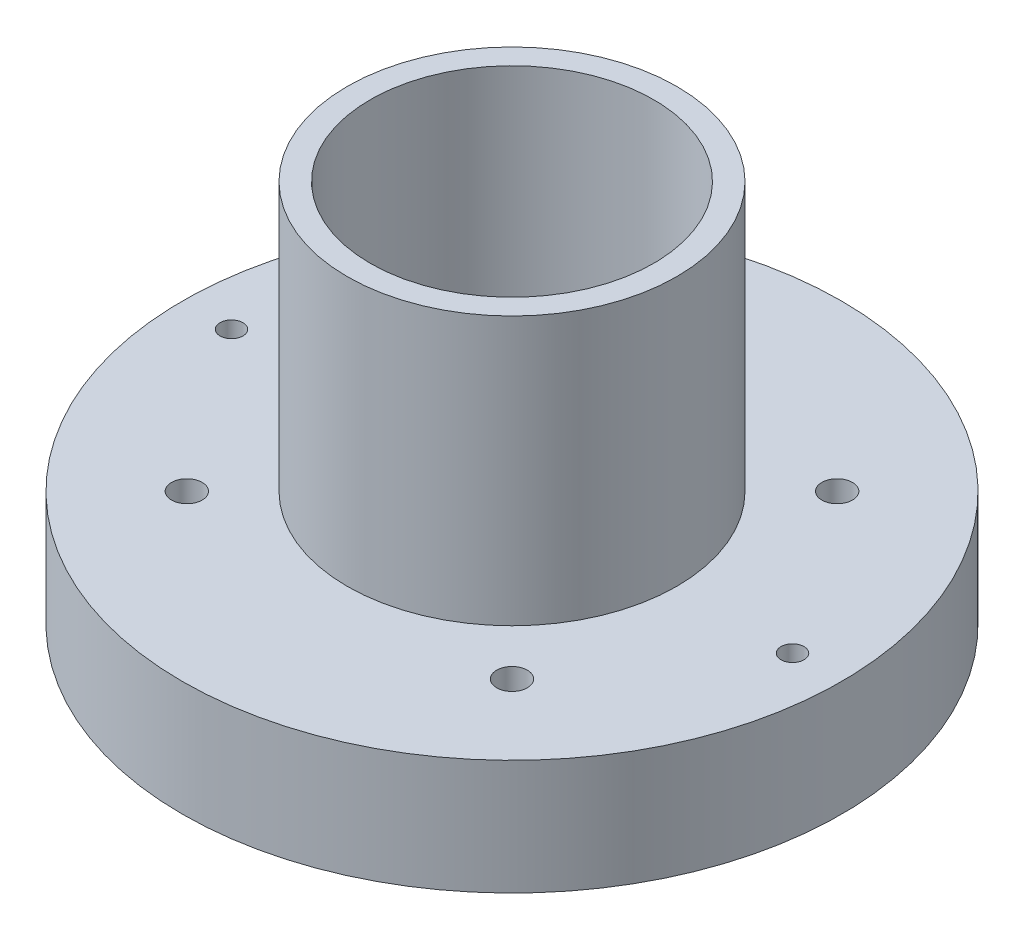
ISO-10303-21;
HEADER;
FILE_DESCRIPTION(('STEP AP214'),'2;1');
FILE_NAME('part.step','',(''),(''),'','','');
FILE_SCHEMA(('AUTOMOTIVE_DESIGN { 1 0 10303 214 1 1 1 1 }'));
ENDSEC;
DATA;
#1=APPLICATION_CONTEXT('core data for automotive mechanical design processes');
#2=APPLICATION_PROTOCOL_DEFINITION('international standard','automotive_design',2000,#1);
#3=PRODUCT_CONTEXT('',#1,'mechanical');
#4=PRODUCT('Part','Part','',(#3));
#5=PRODUCT_RELATED_PRODUCT_CATEGORY('part','',(#4));
#6=PRODUCT_DEFINITION_FORMATION('','',#4);
#7=PRODUCT_DEFINITION_CONTEXT('part definition',#1,'design');
#8=PRODUCT_DEFINITION('design','',#6,#7);
#9=PRODUCT_DEFINITION_SHAPE('','',#8);
#10=(LENGTH_UNIT() NAMED_UNIT(*) SI_UNIT(.MILLI.,.METRE.));
#11=(NAMED_UNIT(*) PLANE_ANGLE_UNIT() SI_UNIT($,.RADIAN.));
#12=(NAMED_UNIT(*) SI_UNIT($,.STERADIAN.) SOLID_ANGLE_UNIT());
#13=UNCERTAINTY_MEASURE_WITH_UNIT(LENGTH_MEASURE(1.E-05),#10,'distance_accuracy_value','');
#14=(GEOMETRIC_REPRESENTATION_CONTEXT(3) GLOBAL_UNCERTAINTY_ASSIGNED_CONTEXT((#13)) GLOBAL_UNIT_ASSIGNED_CONTEXT((#10,
#11,#12)) REPRESENTATION_CONTEXT('',''));
#15=CARTESIAN_POINT('',(0.,0.,0.));
#16=DIRECTION('',(0.,0.,1.));
#17=DIRECTION('',(1.,0.,0.));
#18=AXIS2_PLACEMENT_3D('',#15,#16,#17);
#19=CARTESIAN_POINT('',(0.,30.,0.));
#20=DIRECTION('',(0.,-1.,0.));
#21=DIRECTION('',(0.,0.,-1.));
#22=AXIS2_PLACEMENT_3D('',#19,#20,#21);
#23=CYLINDRICAL_SURFACE('',#22,43.);
#24=CARTESIAN_POINT('',(0.,30.,0.));
#25=DIRECTION('',(0.,1.,0.));
#26=DIRECTION('',(0.,0.,1.));
#27=AXIS2_PLACEMENT_3D('',#24,#25,#26);
#28=CIRCLE('',#27,43.);
#29=CARTESIAN_POINT('',(0.,30.,43.));
#30=VERTEX_POINT('',#29);
#31=EDGE_CURVE('E136',#30,#30,#28,.T.);
#32=ORIENTED_EDGE('',*,*,#31,.F.);
#33=EDGE_LOOP('',(#32));
#34=FACE_BOUND('',#33,.T.);
#35=CARTESIAN_POINT('',(0.,15.,0.));
#36=DIRECTION('',(0.,-1.,0.));
#37=DIRECTION('',(0.,0.,-1.));
#38=AXIS2_PLACEMENT_3D('',#35,#36,#37);
#39=CIRCLE('',#38,43.);
#40=CARTESIAN_POINT('',(0.,15.,-43.));
#41=VERTEX_POINT('',#40);
#42=EDGE_CURVE('E169',#41,#41,#39,.T.);
#43=ORIENTED_EDGE('',*,*,#42,.F.);
#44=EDGE_LOOP('',(#43));
#45=FACE_BOUND('',#44,.T.);
#46=ADVANCED_FACE('F39',(#34,#45),#23,.T.);
#47=CARTESIAN_POINT('',(0.,20.,0.));
#48=DIRECTION('',(0.,-1.,0.));
#49=DIRECTION('',(0.,0.,-1.));
#50=AXIS2_PLACEMENT_3D('',#47,#48,#49);
#51=CYLINDRICAL_SURFACE('',#50,25.);
#52=CARTESIAN_POINT('',(0.,20.,0.));
#53=DIRECTION('',(0.,-1.,0.));
#54=DIRECTION('',(0.,0.,-1.));
#55=AXIS2_PLACEMENT_3D('',#52,#53,#54);
#56=CIRCLE('',#55,25.);
#57=CARTESIAN_POINT('',(0.,20.,-25.));
#58=VERTEX_POINT('',#57);
#59=EDGE_CURVE('E129',#58,#58,#56,.T.);
#60=ORIENTED_EDGE('',*,*,#59,.F.);
#61=EDGE_LOOP('',(#60));
#62=FACE_BOUND('',#61,.T.);
#63=CARTESIAN_POINT('',(0.,15.,0.));
#64=DIRECTION('',(0.,-1.,0.));
#65=DIRECTION('',(0.,0.,-1.));
#66=AXIS2_PLACEMENT_3D('',#63,#64,#65);
#67=CIRCLE('',#66,25.);
#68=CARTESIAN_POINT('',(0.,15.,-25.));
#69=VERTEX_POINT('',#68);
#70=EDGE_CURVE('E199',#69,#69,#67,.F.);
#71=ORIENTED_EDGE('',*,*,#70,.F.);
#72=EDGE_LOOP('',(#71));
#73=FACE_BOUND('',#72,.T.);
#74=ADVANCED_FACE('F194',(#62,#73),#51,.F.);
#75=CARTESIAN_POINT('',(36.6,30.,0.));
#76=DIRECTION('',(0.,1.,0.));
#77=DIRECTION('',(0.,0.,1.));
#78=AXIS2_PLACEMENT_3D('',#75,#76,#77);
#79=CYLINDRICAL_SURFACE('',#78,1.49999999999999);
#80=CARTESIAN_POINT('',(36.6,30.,0.));
#81=DIRECTION('',(0.,1.,0.));
#82=DIRECTION('',(0.,0.,1.));
#83=AXIS2_PLACEMENT_3D('',#80,#81,#82);
#84=CIRCLE('',#83,1.49999999999999);
#85=CARTESIAN_POINT('',(36.6,30.,1.49999999999999));
#86=VERTEX_POINT('',#85);
#87=EDGE_CURVE('E101',#86,#86,#84,.T.);
#88=ORIENTED_EDGE('',*,*,#87,.T.);
#89=EDGE_LOOP('',(#88));
#90=FACE_BOUND('',#89,.T.);
#91=CARTESIAN_POINT('',(36.6,15.,0.));
#92=DIRECTION('',(0.,-1.,0.));
#93=DIRECTION('',(0.,0.,-1.));
#94=AXIS2_PLACEMENT_3D('',#91,#92,#93);
#95=CIRCLE('',#94,1.49999999999999);
#96=CARTESIAN_POINT('',(36.6,15.,-1.49999999999999));
#97=VERTEX_POINT('',#96);
#98=EDGE_CURVE('E202',#97,#97,#95,.F.);
#99=ORIENTED_EDGE('',*,*,#98,.F.);
#100=EDGE_LOOP('',(#99));
#101=FACE_BOUND('',#100,.T.);
#102=ADVANCED_FACE('F179',(#90,#101),#79,.F.);
#103=CARTESIAN_POINT('',(-36.6,30.,0.));
#104=DIRECTION('',(0.,1.,0.));
#105=DIRECTION('',(0.,0.,1.));
#106=AXIS2_PLACEMENT_3D('',#103,#104,#105);
#107=CYLINDRICAL_SURFACE('',#106,1.49999999999999);
#108=CARTESIAN_POINT('',(-36.6,30.,0.));
#109=DIRECTION('',(0.,1.,0.));
#110=DIRECTION('',(0.,0.,1.));
#111=AXIS2_PLACEMENT_3D('',#108,#109,#110);
#112=CIRCLE('',#111,1.49999999999999);
#113=CARTESIAN_POINT('',(-36.6,30.,1.49999999999999));
#114=VERTEX_POINT('',#113);
#115=EDGE_CURVE('E160',#114,#114,#112,.T.);
#116=ORIENTED_EDGE('',*,*,#115,.T.);
#117=EDGE_LOOP('',(#116));
#118=FACE_BOUND('',#117,.T.);
#119=CARTESIAN_POINT('',(-36.6,15.,0.));
#120=DIRECTION('',(0.,-1.,0.));
#121=DIRECTION('',(0.,0.,-1.));
#122=AXIS2_PLACEMENT_3D('',#119,#120,#121);
#123=CIRCLE('',#122,1.49999999999999);
#124=CARTESIAN_POINT('',(-36.6,15.,-1.49999999999999));
#125=VERTEX_POINT('',#124);
#126=EDGE_CURVE('E208',#125,#125,#123,.F.);
#127=ORIENTED_EDGE('',*,*,#126,.F.);
#128=EDGE_LOOP('',(#127));
#129=FACE_BOUND('',#128,.T.);
#130=ADVANCED_FACE('F247',(#118,#129),#107,.F.);
#131=CARTESIAN_POINT('',(-21.2132034355964,0.,-21.2132034355965));
#132=DIRECTION('',(0.,-1.,0.));
#133=DIRECTION('',(0.,0.,-1.));
#134=AXIS2_PLACEMENT_3D('',#131,#132,#133);
#135=CYLINDRICAL_SURFACE('',#134,1.99999999999999);
#136=CARTESIAN_POINT('',(-21.2132034355964,30.,-21.2132034355965));
#137=DIRECTION('',(0.,1.,0.));
#138=DIRECTION('',(0.,0.,1.));
#139=AXIS2_PLACEMENT_3D('',#136,#137,#138);
#140=CIRCLE('',#139,1.99999999999999);
#141=CARTESIAN_POINT('',(-21.2132034355964,30.,-19.2132034355965));
#142=VERTEX_POINT('',#141);
#143=EDGE_CURVE('E153',#142,#142,#140,.T.);
#144=ORIENTED_EDGE('',*,*,#143,.T.);
#145=EDGE_LOOP('',(#144));
#146=FACE_BOUND('',#145,.T.);
#147=CARTESIAN_POINT('',(-21.2132034355964,15.,-21.2132034355965));
#148=DIRECTION('',(0.,-1.,0.));
#149=DIRECTION('',(0.,0.,-1.));
#150=AXIS2_PLACEMENT_3D('',#147,#148,#149);
#151=CIRCLE('',#150,1.99999999999999);
#152=CARTESIAN_POINT('',(-21.2132034355964,15.,-23.2132034355964));
#153=VERTEX_POINT('',#152);
#154=EDGE_CURVE('E212',#153,#153,#151,.F.);
#155=ORIENTED_EDGE('',*,*,#154,.F.);
#156=EDGE_LOOP('',(#155));
#157=FACE_BOUND('',#156,.T.);
#158=ADVANCED_FACE('F244',(#146,#157),#135,.F.);
#159=CARTESIAN_POINT('',(21.2132034355964,0.,-21.2132034355965));
#160=DIRECTION('',(0.,-1.,0.));
#161=DIRECTION('',(0.,0.,-1.));
#162=AXIS2_PLACEMENT_3D('',#159,#160,#161);
#163=CYLINDRICAL_SURFACE('',#162,1.99999999999999);
#164=CARTESIAN_POINT('',(21.2132034355964,30.,-21.2132034355965));
#165=DIRECTION('',(0.,1.,0.));
#166=DIRECTION('',(0.,0.,1.));
#167=AXIS2_PLACEMENT_3D('',#164,#165,#166);
#168=CIRCLE('',#167,1.99999999999999);
#169=CARTESIAN_POINT('',(21.2132034355964,30.,-19.2132034355965));
#170=VERTEX_POINT('',#169);
#171=EDGE_CURVE('E150',#170,#170,#168,.T.);
#172=ORIENTED_EDGE('',*,*,#171,.T.);
#173=EDGE_LOOP('',(#172));
#174=FACE_BOUND('',#173,.T.);
#175=CARTESIAN_POINT('',(21.2132034355964,15.,-21.2132034355965));
#176=DIRECTION('',(0.,-1.,0.));
#177=DIRECTION('',(0.,0.,-1.));
#178=AXIS2_PLACEMENT_3D('',#175,#176,#177);
#179=CIRCLE('',#178,1.99999999999999);
#180=CARTESIAN_POINT('',(21.2132034355964,15.,-23.2132034355965));
#181=VERTEX_POINT('',#180);
#182=EDGE_CURVE('E216',#181,#181,#179,.F.);
#183=ORIENTED_EDGE('',*,*,#182,.F.);
#184=EDGE_LOOP('',(#183));
#185=FACE_BOUND('',#184,.T.);
#186=ADVANCED_FACE('F238',(#174,#185),#163,.F.);
#187=CARTESIAN_POINT('',(-21.2132034355964,0.,21.2132034355965));
#188=DIRECTION('',(0.,-1.,0.));
#189=DIRECTION('',(0.,0.,-1.));
#190=AXIS2_PLACEMENT_3D('',#187,#188,#189);
#191=CYLINDRICAL_SURFACE('',#190,1.99999999999999);
#192=CARTESIAN_POINT('',(-21.2132034355964,30.,21.2132034355965));
#193=DIRECTION('',(0.,1.,0.));
#194=DIRECTION('',(0.,0.,1.));
#195=AXIS2_PLACEMENT_3D('',#192,#193,#194);
#196=CIRCLE('',#195,1.99999999999999);
#197=CARTESIAN_POINT('',(-21.2132034355964,30.,23.2132034355964));
#198=VERTEX_POINT('',#197);
#199=EDGE_CURVE('E154',#198,#198,#196,.T.);
#200=ORIENTED_EDGE('',*,*,#199,.T.);
#201=EDGE_LOOP('',(#200));
#202=FACE_BOUND('',#201,.T.);
#203=CARTESIAN_POINT('',(-21.2132034355964,15.,21.2132034355965));
#204=DIRECTION('',(0.,-1.,0.));
#205=DIRECTION('',(0.,0.,-1.));
#206=AXIS2_PLACEMENT_3D('',#203,#204,#205);
#207=CIRCLE('',#206,1.99999999999999);
#208=CARTESIAN_POINT('',(-21.2132034355964,15.,19.2132034355965));
#209=VERTEX_POINT('',#208);
#210=EDGE_CURVE('E220',#209,#209,#207,.F.);
#211=ORIENTED_EDGE('',*,*,#210,.F.);
#212=EDGE_LOOP('',(#211));
#213=FACE_BOUND('',#212,.T.);
#214=ADVANCED_FACE('F232',(#202,#213),#191,.F.);
#215=CARTESIAN_POINT('',(21.2132034355964,0.,21.2132034355965));
#216=DIRECTION('',(0.,-1.,0.));
#217=DIRECTION('',(0.,0.,-1.));
#218=AXIS2_PLACEMENT_3D('',#215,#216,#217);
#219=CYLINDRICAL_SURFACE('',#218,1.99999999999999);
#220=CARTESIAN_POINT('',(21.2132034355964,30.,21.2132034355965));
#221=DIRECTION('',(0.,1.,0.));
#222=DIRECTION('',(0.,0.,1.));
#223=AXIS2_PLACEMENT_3D('',#220,#221,#222);
#224=CIRCLE('',#223,1.99999999999999);
#225=CARTESIAN_POINT('',(21.2132034355964,30.,23.2132034355965));
#226=VERTEX_POINT('',#225);
#227=EDGE_CURVE('E163',#226,#226,#224,.T.);
#228=ORIENTED_EDGE('',*,*,#227,.T.);
#229=EDGE_LOOP('',(#228));
#230=FACE_BOUND('',#229,.T.);
#231=CARTESIAN_POINT('',(21.2132034355964,15.,21.2132034355965));
#232=DIRECTION('',(0.,-1.,0.));
#233=DIRECTION('',(0.,0.,-1.));
#234=AXIS2_PLACEMENT_3D('',#231,#232,#233);
#235=CIRCLE('',#234,1.99999999999999);
#236=CARTESIAN_POINT('',(21.2132034355964,15.,19.2132034355965));
#237=VERTEX_POINT('',#236);
#238=EDGE_CURVE('E42',#237,#237,#235,.F.);
#239=ORIENTED_EDGE('',*,*,#238,.F.);
#240=EDGE_LOOP('',(#239));
#241=FACE_BOUND('',#240,.T.);
#242=ADVANCED_FACE('F186',(#230,#241),#219,.F.);
#243=CARTESIAN_POINT('',(0.,30.,0.));
#244=DIRECTION('',(0.,1.,0.));
#245=DIRECTION('',(0.,0.,1.));
#246=AXIS2_PLACEMENT_3D('',#243,#244,#245);
#247=PLANE('',#246);
#248=ORIENTED_EDGE('',*,*,#227,.F.);
#249=EDGE_LOOP('',(#248));
#250=FACE_BOUND('',#249,.T.);
#251=ORIENTED_EDGE('',*,*,#199,.F.);
#252=EDGE_LOOP('',(#251));
#253=FACE_BOUND('',#252,.T.);
#254=ORIENTED_EDGE('',*,*,#171,.F.);
#255=EDGE_LOOP('',(#254));
#256=FACE_BOUND('',#255,.T.);
#257=ORIENTED_EDGE('',*,*,#143,.F.);
#258=EDGE_LOOP('',(#257));
#259=FACE_BOUND('',#258,.T.);
#260=ORIENTED_EDGE('',*,*,#115,.F.);
#261=EDGE_LOOP('',(#260));
#262=FACE_BOUND('',#261,.T.);
#263=ORIENTED_EDGE('',*,*,#87,.F.);
#264=EDGE_LOOP('',(#263));
#265=FACE_BOUND('',#264,.T.);
#266=CARTESIAN_POINT('',(0.,30.,0.));
#267=DIRECTION('',(0.,1.,0.));
#268=DIRECTION('',(0.,0.,1.));
#269=AXIS2_PLACEMENT_3D('',#266,#267,#268);
#270=CIRCLE('',#269,21.5);
#271=CARTESIAN_POINT('',(0.,30.,21.5));
#272=VERTEX_POINT('',#271);
#273=EDGE_CURVE('E124',#272,#272,#270,.T.);
#274=ORIENTED_EDGE('',*,*,#273,.F.);
#275=EDGE_LOOP('',(#274));
#276=FACE_BOUND('',#275,.T.);
#277=ORIENTED_EDGE('',*,*,#31,.T.);
#278=EDGE_LOOP('',(#277));
#279=FACE_BOUND('',#278,.T.);
#280=ADVANCED_FACE('F182',(#250,#253,#256,#259,#262,#265,#276,#279),#247,.T.);
#281=CARTESIAN_POINT('',(0.,20.,0.));
#282=DIRECTION('',(0.,-1.,0.));
#283=DIRECTION('',(0.,0.,-1.));
#284=AXIS2_PLACEMENT_3D('',#281,#282,#283);
#285=PLANE('',#284);
#286=CARTESIAN_POINT('',(-9.5,20.,0.));
#287=DIRECTION('',(0.,-1.,0.));
#288=DIRECTION('',(0.,0.,-1.));
#289=AXIS2_PLACEMENT_3D('',#286,#287,#288);
#290=CIRCLE('',#289,6.);
#291=CARTESIAN_POINT('',(-9.5,20.,6.));
#292=VERTEX_POINT('',#291);
#293=CARTESIAN_POINT('',(-9.50000000000001,20.,-6.));
#294=VERTEX_POINT('',#293);
#295=EDGE_CURVE('E11',#292,#294,#290,.T.);
#296=ORIENTED_EDGE('',*,*,#295,.F.);
#297=DIRECTION('',(-1.,0.,0.));
#298=VECTOR('',#297,1.);
#299=CARTESIAN_POINT('',(0.,20.,6.));
#300=LINE('',#299,#298);
#301=CARTESIAN_POINT('',(9.5,20.,5.99999999999999));
#302=VERTEX_POINT('',#301);
#303=EDGE_CURVE('E86',#302,#292,#300,.T.);
#304=ORIENTED_EDGE('',*,*,#303,.F.);
#305=CARTESIAN_POINT('',(9.5,20.,0.));
#306=DIRECTION('',(0.,-1.,0.));
#307=DIRECTION('',(0.,0.,-1.));
#308=AXIS2_PLACEMENT_3D('',#305,#306,#307);
#309=CIRCLE('',#308,6.);
#310=CARTESIAN_POINT('',(9.49999999999999,20.,-6.00000000000001));
#311=VERTEX_POINT('',#310);
#312=EDGE_CURVE('E146',#311,#302,#309,.T.);
#313=ORIENTED_EDGE('',*,*,#312,.F.);
#314=DIRECTION('',(1.,0.,0.));
#315=VECTOR('',#314,1.);
#316=CARTESIAN_POINT('',(0.,20.,-6.));
#317=LINE('',#316,#315);
#318=EDGE_CURVE('E48',#294,#311,#317,.T.);
#319=ORIENTED_EDGE('',*,*,#318,.F.);
#320=EDGE_LOOP('',(#296,#304,#313,#319));
#321=FACE_BOUND('',#320,.T.);
#322=ORIENTED_EDGE('',*,*,#59,.T.);
#323=EDGE_LOOP('',(#322));
#324=FACE_BOUND('',#323,.T.);
#325=ADVANCED_FACE('F185',(#321,#324),#285,.T.);
#326=CARTESIAN_POINT('',(0.,65.,0.));
#327=DIRECTION('',(0.,1.,0.));
#328=DIRECTION('',(0.,0.,1.));
#329=AXIS2_PLACEMENT_3D('',#326,#327,#328);
#330=PLANE('',#329);
#331=CARTESIAN_POINT('',(0.,65.,0.));
#332=DIRECTION('',(0.,1.,0.));
#333=DIRECTION('',(0.,0.,1.));
#334=AXIS2_PLACEMENT_3D('',#331,#332,#333);
#335=CIRCLE('',#334,21.5);
#336=CARTESIAN_POINT('',(0.,65.,21.5));
#337=VERTEX_POINT('',#336);
#338=EDGE_CURVE('E125',#337,#337,#335,.T.);
#339=ORIENTED_EDGE('',*,*,#338,.T.);
#340=EDGE_LOOP('',(#339));
#341=FACE_BOUND('',#340,.T.);
#342=CARTESIAN_POINT('',(0.,65.,0.));
#343=DIRECTION('',(0.,1.,0.));
#344=DIRECTION('',(0.,0.,1.));
#345=AXIS2_PLACEMENT_3D('',#342,#343,#344);
#346=CIRCLE('',#345,18.5);
#347=CARTESIAN_POINT('',(0.,65.,18.5));
#348=VERTEX_POINT('',#347);
#349=EDGE_CURVE('E115',#348,#348,#346,.T.);
#350=ORIENTED_EDGE('',*,*,#349,.F.);
#351=EDGE_LOOP('',(#350));
#352=FACE_BOUND('',#351,.T.);
#353=ADVANCED_FACE('F270',(#341,#352),#330,.T.);
#354=CARTESIAN_POINT('',(0.,65.,0.));
#355=DIRECTION('',(0.,-1.,0.));
#356=DIRECTION('',(0.,0.,-1.));
#357=AXIS2_PLACEMENT_3D('',#354,#355,#356);
#358=CYLINDRICAL_SURFACE('',#357,21.5);
#359=ORIENTED_EDGE('',*,*,#338,.F.);
#360=EDGE_LOOP('',(#359));
#361=FACE_BOUND('',#360,.T.);
#362=ORIENTED_EDGE('',*,*,#273,.T.);
#363=EDGE_LOOP('',(#362));
#364=FACE_BOUND('',#363,.T.);
#365=ADVANCED_FACE('F268',(#361,#364),#358,.T.);
#366=CARTESIAN_POINT('',(0.,65.,0.));
#367=DIRECTION('',(0.,-1.,0.));
#368=DIRECTION('',(0.,0.,-1.));
#369=AXIS2_PLACEMENT_3D('',#366,#367,#368);
#370=CYLINDRICAL_SURFACE('',#369,18.5);
#371=ORIENTED_EDGE('',*,*,#349,.T.);
#372=EDGE_LOOP('',(#371));
#373=FACE_BOUND('',#372,.T.);
#374=CARTESIAN_POINT('',(0.,30.,0.));
#375=DIRECTION('',(0.,1.,0.));
#376=DIRECTION('',(0.,0.,1.));
#377=AXIS2_PLACEMENT_3D('',#374,#375,#376);
#378=CIRCLE('',#377,18.5);
#379=CARTESIAN_POINT('',(0.,30.,18.5));
#380=VERTEX_POINT('',#379);
#381=EDGE_CURVE('E140',#380,#380,#378,.F.);
#382=ORIENTED_EDGE('',*,*,#381,.T.);
#383=EDGE_LOOP('',(#382));
#384=FACE_BOUND('',#383,.T.);
#385=ADVANCED_FACE('F265',(#373,#384),#370,.F.);
#386=CARTESIAN_POINT('',(-9.5,30.,0.));
#387=DIRECTION('',(0.,1.,0.));
#388=DIRECTION('',(0.,0.,1.));
#389=AXIS2_PLACEMENT_3D('',#386,#387,#388);
#390=CIRCLE('',#389,6.);
#391=CARTESIAN_POINT('',(-9.50000000000001,30.,-6.));
#392=VERTEX_POINT('',#391);
#393=CARTESIAN_POINT('',(-9.5,30.,6.));
#394=VERTEX_POINT('',#393);
#395=EDGE_CURVE('E93',#392,#394,#390,.T.);
#396=ORIENTED_EDGE('',*,*,#395,.F.);
#397=DIRECTION('',(-1.,0.,0.));
#398=VECTOR('',#397,1.);
#399=CARTESIAN_POINT('',(-9.50000000000001,30.,-6.));
#400=LINE('',#399,#398);
#401=CARTESIAN_POINT('',(9.49999999999999,30.,-6.00000000000001));
#402=VERTEX_POINT('',#401);
#403=EDGE_CURVE('E90',#402,#392,#400,.T.);
#404=ORIENTED_EDGE('',*,*,#403,.F.);
#405=CARTESIAN_POINT('',(9.5,30.,0.));
#406=DIRECTION('',(0.,1.,0.));
#407=DIRECTION('',(0.,0.,1.));
#408=AXIS2_PLACEMENT_3D('',#405,#406,#407);
#409=CIRCLE('',#408,6.);
#410=CARTESIAN_POINT('',(9.5,30.,5.99999999999999));
#411=VERTEX_POINT('',#410);
#412=EDGE_CURVE('E56',#411,#402,#409,.T.);
#413=ORIENTED_EDGE('',*,*,#412,.F.);
#414=DIRECTION('',(1.,0.,0.));
#415=VECTOR('',#414,1.);
#416=CARTESIAN_POINT('',(-9.5,30.,6.));
#417=LINE('',#416,#415);
#418=EDGE_CURVE('E84',#394,#411,#417,.T.);
#419=ORIENTED_EDGE('',*,*,#418,.F.);
#420=EDGE_LOOP('',(#396,#404,#413,#419));
#421=FACE_BOUND('',#420,.T.);
#422=ORIENTED_EDGE('',*,*,#381,.F.);
#423=EDGE_LOOP('',(#422));
#424=FACE_BOUND('',#423,.T.);
#425=ADVANCED_FACE('F103',(#421,#424),#247,.T.);
#426=CARTESIAN_POINT('',(-9.5,0.,0.));
#427=DIRECTION('',(0.,1.,0.));
#428=DIRECTION('',(0.,0.,1.));
#429=AXIS2_PLACEMENT_3D('',#426,#427,#428);
#430=CYLINDRICAL_SURFACE('',#429,6.);
#431=ORIENTED_EDGE('',*,*,#295,.T.);
#432=DIRECTION('',(0.,1.,0.));
#433=VECTOR('',#432,1.);
#434=CARTESIAN_POINT('',(-9.50000000000001,0.,-6.));
#435=LINE('',#434,#433);
#436=EDGE_CURVE('E96',#294,#392,#435,.T.);
#437=ORIENTED_EDGE('',*,*,#436,.T.);
#438=ORIENTED_EDGE('',*,*,#395,.T.);
#439=DIRECTION('',(0.,1.,0.));
#440=VECTOR('',#439,1.);
#441=CARTESIAN_POINT('',(-9.5,0.,6.));
#442=LINE('',#441,#440);
#443=EDGE_CURVE('E80',#292,#394,#442,.T.);
#444=ORIENTED_EDGE('',*,*,#443,.F.);
#445=EDGE_LOOP('',(#431,#437,#438,#444));
#446=FACE_BOUND('',#445,.T.);
#447=ADVANCED_FACE('F94',(#446),#430,.F.);
#448=CARTESIAN_POINT('',(-9.50000000000001,0.,-6.));
#449=DIRECTION('',(0.,0.,-1.));
#450=DIRECTION('',(-1.,0.,0.));
#451=AXIS2_PLACEMENT_3D('',#448,#449,#450);
#452=PLANE('',#451);
#453=ORIENTED_EDGE('',*,*,#318,.T.);
#454=DIRECTION('',(0.,1.,0.));
#455=VECTOR('',#454,1.);
#456=CARTESIAN_POINT('',(9.49999999999999,0.,-6.00000000000001));
#457=LINE('',#456,#455);
#458=EDGE_CURVE('E116',#311,#402,#457,.T.);
#459=ORIENTED_EDGE('',*,*,#458,.T.);
#460=ORIENTED_EDGE('',*,*,#403,.T.);
#461=ORIENTED_EDGE('',*,*,#436,.F.);
#462=EDGE_LOOP('',(#453,#459,#460,#461));
#463=FACE_BOUND('',#462,.T.);
#464=ADVANCED_FACE('F254',(#463),#452,.F.);
#465=CARTESIAN_POINT('',(9.5,0.,0.));
#466=DIRECTION('',(0.,1.,0.));
#467=DIRECTION('',(0.,0.,1.));
#468=AXIS2_PLACEMENT_3D('',#465,#466,#467);
#469=CYLINDRICAL_SURFACE('',#468,6.);
#470=ORIENTED_EDGE('',*,*,#312,.T.);
#471=DIRECTION('',(0.,1.,0.));
#472=VECTOR('',#471,1.);
#473=CARTESIAN_POINT('',(9.5,0.,5.99999999999999));
#474=LINE('',#473,#472);
#475=EDGE_CURVE('E63',#302,#411,#474,.T.);
#476=ORIENTED_EDGE('',*,*,#475,.T.);
#477=ORIENTED_EDGE('',*,*,#412,.T.);
#478=ORIENTED_EDGE('',*,*,#458,.F.);
#479=EDGE_LOOP('',(#470,#476,#477,#478));
#480=FACE_BOUND('',#479,.T.);
#481=ADVANCED_FACE('F257',(#480),#469,.F.);
#482=CARTESIAN_POINT('',(-9.5,0.,6.));
#483=DIRECTION('',(0.,0.,1.));
#484=DIRECTION('',(1.,0.,0.));
#485=AXIS2_PLACEMENT_3D('',#482,#483,#484);
#486=PLANE('',#485);
#487=ORIENTED_EDGE('',*,*,#303,.T.);
#488=ORIENTED_EDGE('',*,*,#443,.T.);
#489=ORIENTED_EDGE('',*,*,#418,.T.);
#490=ORIENTED_EDGE('',*,*,#475,.F.);
#491=EDGE_LOOP('',(#487,#488,#489,#490));
#492=FACE_BOUND('',#491,.T.);
#493=ADVANCED_FACE('F82',(#492),#486,.F.);
#494=CARTESIAN_POINT('',(0.,15.,0.));
#495=DIRECTION('',(0.,-1.,0.));
#496=DIRECTION('',(0.,0.,-1.));
#497=AXIS2_PLACEMENT_3D('',#494,#495,#496);
#498=PLANE('',#497);
#499=ORIENTED_EDGE('',*,*,#70,.T.);
#500=EDGE_LOOP('',(#499));
#501=FACE_BOUND('',#500,.T.);
#502=ORIENTED_EDGE('',*,*,#98,.T.);
#503=EDGE_LOOP('',(#502));
#504=FACE_BOUND('',#503,.T.);
#505=ORIENTED_EDGE('',*,*,#126,.T.);
#506=EDGE_LOOP('',(#505));
#507=FACE_BOUND('',#506,.T.);
#508=ORIENTED_EDGE('',*,*,#154,.T.);
#509=EDGE_LOOP('',(#508));
#510=FACE_BOUND('',#509,.T.);
#511=ORIENTED_EDGE('',*,*,#182,.T.);
#512=EDGE_LOOP('',(#511));
#513=FACE_BOUND('',#512,.T.);
#514=ORIENTED_EDGE('',*,*,#210,.T.);
#515=EDGE_LOOP('',(#514));
#516=FACE_BOUND('',#515,.T.);
#517=ORIENTED_EDGE('',*,*,#238,.T.);
#518=EDGE_LOOP('',(#517));
#519=FACE_BOUND('',#518,.T.);
#520=ORIENTED_EDGE('',*,*,#42,.T.);
#521=EDGE_LOOP('',(#520));
#522=FACE_BOUND('',#521,.T.);
#523=ADVANCED_FACE('F229',(#501,#504,#507,#510,#513,#516,#519,#522),#498,.T.);
#524=CLOSED_SHELL('',(#46,#74,#102,#130,#158,#186,#214,#242,#280,#325,#353,#365,#385,#425,#447,
#464,#481,#493,#523));
#525=MANIFOLD_SOLID_BREP('B2',#524);
#526=ADVANCED_BREP_SHAPE_REPRESENTATION('',(#18,#525),#14);
#527=SHAPE_DEFINITION_REPRESENTATION(#9,#526);
ENDSEC;
END-ISO-10303-21;
